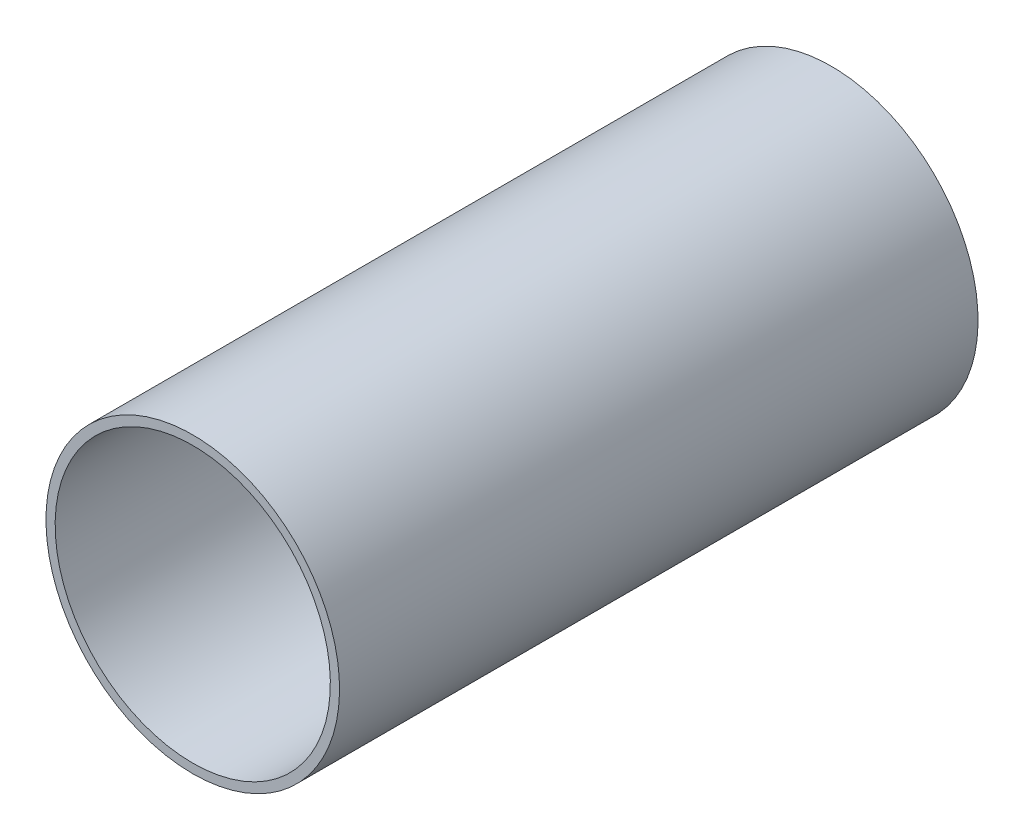
ISO-10303-21;
HEADER;
FILE_DESCRIPTION(('STEP AP214'),'2;1');
FILE_NAME('part.step','',(''),(''),'','','');
FILE_SCHEMA(('AUTOMOTIVE_DESIGN { 1 0 10303 214 1 1 1 1 }'));
ENDSEC;
DATA;
#1=APPLICATION_CONTEXT('core data for automotive mechanical design processes');
#2=APPLICATION_PROTOCOL_DEFINITION('international standard','automotive_design',2000,#1);
#3=PRODUCT_CONTEXT('',#1,'mechanical');
#4=PRODUCT('Part','Part','',(#3));
#5=PRODUCT_RELATED_PRODUCT_CATEGORY('part','',(#4));
#6=PRODUCT_DEFINITION_FORMATION('','',#4);
#7=PRODUCT_DEFINITION_CONTEXT('part definition',#1,'design');
#8=PRODUCT_DEFINITION('design','',#6,#7);
#9=PRODUCT_DEFINITION_SHAPE('','',#8);
#10=(LENGTH_UNIT() NAMED_UNIT(*) SI_UNIT(.MILLI.,.METRE.));
#11=(NAMED_UNIT(*) PLANE_ANGLE_UNIT() SI_UNIT($,.RADIAN.));
#12=(NAMED_UNIT(*) SI_UNIT($,.STERADIAN.) SOLID_ANGLE_UNIT());
#13=UNCERTAINTY_MEASURE_WITH_UNIT(LENGTH_MEASURE(1.E-05),#10,'distance_accuracy_value','');
#14=(GEOMETRIC_REPRESENTATION_CONTEXT(3) GLOBAL_UNCERTAINTY_ASSIGNED_CONTEXT((#13)) GLOBAL_UNIT_ASSIGNED_CONTEXT((#10,
#11,#12)) REPRESENTATION_CONTEXT('',''));
#15=CARTESIAN_POINT('',(0.,0.,0.));
#16=DIRECTION('',(0.,0.,1.));
#17=DIRECTION('',(1.,0.,0.));
#18=AXIS2_PLACEMENT_3D('',#15,#16,#17);
#19=CARTESIAN_POINT('',(155.448,-72.644,-0.045));
#20=DIRECTION('',(0.,0.,-1.));
#21=DIRECTION('',(0.,-1.,0.));
#22=AXIS2_PLACEMENT_3D('',#19,#20,#21);
#23=CYLINDRICAL_SURFACE('',#22,0.375);
#24=CARTESIAN_POINT('',(155.448,-72.644,-0.035));
#25=DIRECTION('',(0.,0.,-1.));
#26=DIRECTION('',(0.,-1.,0.));
#27=AXIS2_PLACEMENT_3D('',#24,#25,#26);
#28=CIRCLE('',#27,0.375);
#29=CARTESIAN_POINT('',(155.448,-73.019,-0.035));
#30=VERTEX_POINT('',#29);
#31=EDGE_CURVE('E64',#30,#30,#28,.T.);
#32=ORIENTED_EDGE('',*,*,#31,.T.);
#33=DIRECTION('',(0.,0.,1.));
#34=VECTOR('',#33,1.);
#35=CARTESIAN_POINT('',(155.448,-73.019,-0.045));
#36=LINE('',#35,#34);
#37=CARTESIAN_POINT('',(155.448,-73.019,1.705));
#38=VERTEX_POINT('',#37);
#39=EDGE_CURVE('E11',#30,#38,#36,.T.);
#40=ORIENTED_EDGE('',*,*,#39,.T.);
#41=CARTESIAN_POINT('',(155.448,-72.644,1.705));
#42=DIRECTION('',(0.,0.,-1.));
#43=DIRECTION('',(0.,-1.,0.));
#44=AXIS2_PLACEMENT_3D('',#41,#42,#43);
#45=CIRCLE('',#44,0.375);
#46=EDGE_CURVE('E25',#38,#38,#45,.T.);
#47=ORIENTED_EDGE('',*,*,#46,.F.);
#48=ORIENTED_EDGE('',*,*,#39,.F.);
#49=EDGE_LOOP('',(#32,#40,#47,#48));
#50=FACE_BOUND('',#49,.T.);
#51=ADVANCED_FACE('F17',(#50),#23,.F.);
#52=CARTESIAN_POINT('',(155.448,-73.044,1.705));
#53=DIRECTION('',(0.,0.,1.));
#54=DIRECTION('',(1.,0.,0.));
#55=AXIS2_PLACEMENT_3D('',#52,#53,#54);
#56=PLANE('',#55);
#57=ORIENTED_EDGE('',*,*,#46,.T.);
#58=EDGE_LOOP('',(#57));
#59=FACE_BOUND('',#58,.T.);
#60=CARTESIAN_POINT('',(155.448,-72.644,1.705));
#61=DIRECTION('',(0.,0.,1.));
#62=DIRECTION('',(0.,-1.,0.));
#63=AXIS2_PLACEMENT_3D('',#60,#61,#62);
#64=CIRCLE('',#63,0.4);
#65=CARTESIAN_POINT('',(155.448,-73.044,1.705));
#66=VERTEX_POINT('',#65);
#67=EDGE_CURVE('E56',#66,#66,#64,.T.);
#68=ORIENTED_EDGE('',*,*,#67,.T.);
#69=EDGE_LOOP('',(#68));
#70=FACE_BOUND('',#69,.T.);
#71=ADVANCED_FACE('F73',(#59,#70),#56,.T.);
#72=CARTESIAN_POINT('',(155.448,-73.044,-0.035));
#73=DIRECTION('',(0.,0.,1.));
#74=DIRECTION('',(1.,0.,0.));
#75=AXIS2_PLACEMENT_3D('',#72,#73,#74);
#76=PLANE('',#75);
#77=ORIENTED_EDGE('',*,*,#31,.F.);
#78=EDGE_LOOP('',(#77));
#79=FACE_BOUND('',#78,.T.);
#80=CARTESIAN_POINT('',(155.448,-72.644,-0.035));
#81=DIRECTION('',(0.,0.,1.));
#82=DIRECTION('',(0.,-1.,0.));
#83=AXIS2_PLACEMENT_3D('',#80,#81,#82);
#84=CIRCLE('',#83,0.4);
#85=CARTESIAN_POINT('',(155.448,-73.044,-0.035));
#86=VERTEX_POINT('',#85);
#87=EDGE_CURVE('E55',#86,#86,#84,.T.);
#88=ORIENTED_EDGE('',*,*,#87,.F.);
#89=EDGE_LOOP('',(#88));
#90=FACE_BOUND('',#89,.T.);
#91=ADVANCED_FACE('F82',(#79,#90),#76,.F.);
#92=CARTESIAN_POINT('',(155.448,-72.644,-0.035));
#93=DIRECTION('',(0.,0.,-1.));
#94=DIRECTION('',(0.,-1.,0.));
#95=AXIS2_PLACEMENT_3D('',#92,#93,#94);
#96=CYLINDRICAL_SURFACE('',#95,0.4);
#97=ORIENTED_EDGE('',*,*,#87,.T.);
#98=DIRECTION('',(0.,0.,1.));
#99=VECTOR('',#98,1.);
#100=CARTESIAN_POINT('',(155.448,-73.044,-0.035));
#101=LINE('',#100,#99);
#102=EDGE_CURVE('E52',#86,#66,#101,.T.);
#103=ORIENTED_EDGE('',*,*,#102,.T.);
#104=ORIENTED_EDGE('',*,*,#67,.F.);
#105=ORIENTED_EDGE('',*,*,#102,.F.);
#106=EDGE_LOOP('',(#97,#103,#104,#105));
#107=FACE_BOUND('',#106,.T.);
#108=ADVANCED_FACE('F53',(#107),#96,.T.);
#109=CLOSED_SHELL('',(#51,#71,#91,#108));
#110=MANIFOLD_SOLID_BREP('B1',#109);
#111=ADVANCED_BREP_SHAPE_REPRESENTATION('',(#18,#110),#14);
#112=SHAPE_DEFINITION_REPRESENTATION(#9,#111);
ENDSEC;
END-ISO-10303-21;
